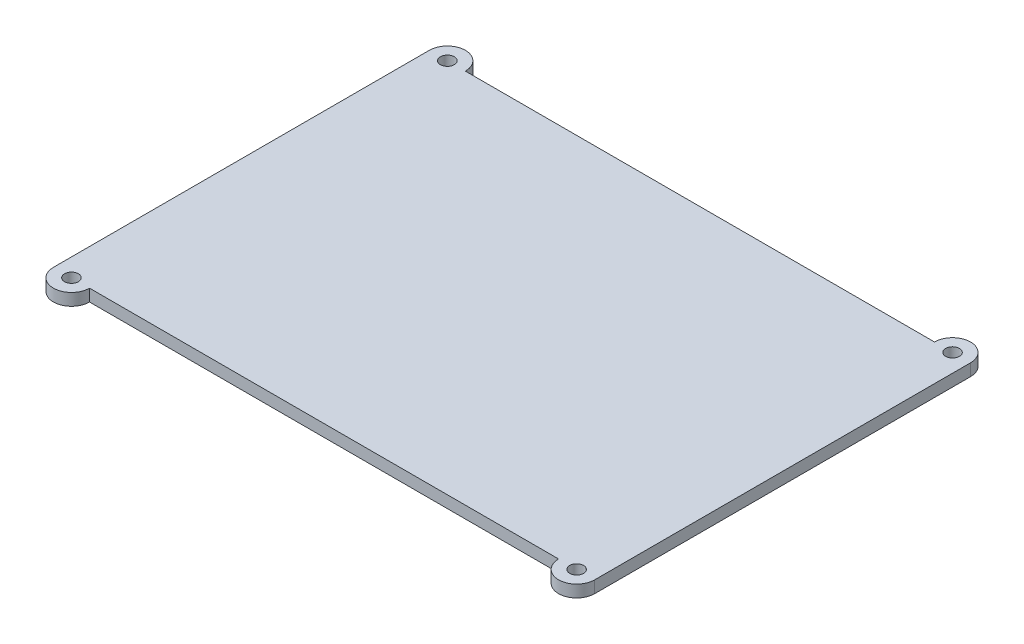
ISO-10303-21;
HEADER;
FILE_DESCRIPTION(('STEP AP214'),'2;1');
FILE_NAME('part.step','',(''),(''),'','','');
FILE_SCHEMA(('AUTOMOTIVE_DESIGN { 1 0 10303 214 1 1 1 1 }'));
ENDSEC;
DATA;
#1=APPLICATION_CONTEXT('core data for automotive mechanical design processes');
#2=APPLICATION_PROTOCOL_DEFINITION('international standard','automotive_design',2000,#1);
#3=PRODUCT_CONTEXT('',#1,'mechanical');
#4=PRODUCT('Part','Part','',(#3));
#5=PRODUCT_RELATED_PRODUCT_CATEGORY('part','',(#4));
#6=PRODUCT_DEFINITION_FORMATION('','',#4);
#7=PRODUCT_DEFINITION_CONTEXT('part definition',#1,'design');
#8=PRODUCT_DEFINITION('design','',#6,#7);
#9=PRODUCT_DEFINITION_SHAPE('','',#8);
#10=(LENGTH_UNIT() NAMED_UNIT(*) SI_UNIT(.MILLI.,.METRE.));
#11=(NAMED_UNIT(*) PLANE_ANGLE_UNIT() SI_UNIT($,.RADIAN.));
#12=(NAMED_UNIT(*) SI_UNIT($,.STERADIAN.) SOLID_ANGLE_UNIT());
#13=UNCERTAINTY_MEASURE_WITH_UNIT(LENGTH_MEASURE(1.E-05),#10,'distance_accuracy_value','');
#14=(GEOMETRIC_REPRESENTATION_CONTEXT(3) GLOBAL_UNCERTAINTY_ASSIGNED_CONTEXT((#13)) GLOBAL_UNIT_ASSIGNED_CONTEXT((#10,
#11,#12)) REPRESENTATION_CONTEXT('',''));
#15=CARTESIAN_POINT('',(0.,0.,0.));
#16=DIRECTION('',(0.,0.,1.));
#17=DIRECTION('',(1.,0.,0.));
#18=AXIS2_PLACEMENT_3D('',#15,#16,#17);
#19=CARTESIAN_POINT('',(3.,0.,0.));
#20=DIRECTION('',(0.,1.,0.));
#21=DIRECTION('',(0.,0.,1.));
#22=AXIS2_PLACEMENT_3D('',#19,#20,#21);
#23=PLANE('',#22);
#24=CARTESIAN_POINT('',(3.,0.,0.));
#25=DIRECTION('',(0.,1.,0.));
#26=DIRECTION('',(0.,0.,1.));
#27=AXIS2_PLACEMENT_3D('',#24,#25,#26);
#28=CIRCLE('',#27,3.);
#29=CARTESIAN_POINT('',(0.,0.,0.));
#30=VERTEX_POINT('',#29);
#31=CARTESIAN_POINT('',(6.,0.,0.));
#32=VERTEX_POINT('',#31);
#33=EDGE_CURVE('E174',#30,#32,#28,.T.);
#34=ORIENTED_EDGE('',*,*,#33,.F.);
#35=DIRECTION('',(0.,0.,1.));
#36=VECTOR('',#35,1.);
#37=CARTESIAN_POINT('',(0.,0.,0.));
#38=LINE('',#37,#36);
#39=CARTESIAN_POINT('',(0.,0.,-62.5));
#40=VERTEX_POINT('',#39);
#41=EDGE_CURVE('E181',#40,#30,#38,.T.);
#42=ORIENTED_EDGE('',*,*,#41,.F.);
#43=CARTESIAN_POINT('',(3.00000000000001,0.,-62.5));
#44=DIRECTION('',(0.,1.,0.));
#45=DIRECTION('',(0.,0.,-1.));
#46=AXIS2_PLACEMENT_3D('',#43,#44,#45);
#47=CIRCLE('',#46,3.00000000000002);
#48=CARTESIAN_POINT('',(6.00000000000002,0.,-62.5));
#49=VERTEX_POINT('',#48);
#50=EDGE_CURVE('E208',#49,#40,#47,.T.);
#51=ORIENTED_EDGE('',*,*,#50,.F.);
#52=DIRECTION('',(-1.,0.,0.));
#53=VECTOR('',#52,1.);
#54=CARTESIAN_POINT('',(6.00000000000001,0.,-62.5));
#55=LINE('',#54,#53);
#56=CARTESIAN_POINT('',(84.,0.,-62.5));
#57=VERTEX_POINT('',#56);
#58=EDGE_CURVE('E206',#57,#49,#55,.T.);
#59=ORIENTED_EDGE('',*,*,#58,.F.);
#60=CARTESIAN_POINT('',(87.,0.,-62.5));
#61=DIRECTION('',(0.,1.,0.));
#62=DIRECTION('',(0.,0.,1.));
#63=AXIS2_PLACEMENT_3D('',#60,#61,#62);
#64=CIRCLE('',#63,3.00000000000001);
#65=CARTESIAN_POINT('',(90.,0.,-62.5));
#66=VERTEX_POINT('',#65);
#67=EDGE_CURVE('E204',#66,#57,#64,.T.);
#68=ORIENTED_EDGE('',*,*,#67,.F.);
#69=DIRECTION('',(0.,0.,-1.));
#70=VECTOR('',#69,1.);
#71=CARTESIAN_POINT('',(90.,0.,0.));
#72=LINE('',#71,#70);
#73=CARTESIAN_POINT('',(90.,0.,0.));
#74=VERTEX_POINT('',#73);
#75=EDGE_CURVE('E202',#74,#66,#72,.T.);
#76=ORIENTED_EDGE('',*,*,#75,.F.);
#77=CARTESIAN_POINT('',(87.,0.,0.));
#78=DIRECTION('',(0.,1.,0.));
#79=DIRECTION('',(0.,0.,-1.));
#80=AXIS2_PLACEMENT_3D('',#77,#78,#79);
#81=CIRCLE('',#80,3.00000000000001);
#82=CARTESIAN_POINT('',(84.,0.,0.));
#83=VERTEX_POINT('',#82);
#84=EDGE_CURVE('E200',#83,#74,#81,.T.);
#85=ORIENTED_EDGE('',*,*,#84,.F.);
#86=DIRECTION('',(1.,0.,0.));
#87=VECTOR('',#86,1.);
#88=CARTESIAN_POINT('',(6.,0.,0.));
#89=LINE('',#88,#87);
#90=EDGE_CURVE('E198',#32,#83,#89,.T.);
#91=ORIENTED_EDGE('',*,*,#90,.F.);
#92=EDGE_LOOP('',(#34,#42,#51,#59,#68,#76,#85,#91));
#93=FACE_BOUND('',#92,.T.);
#94=CARTESIAN_POINT('',(3.00000000000001,0.,-62.5));
#95=DIRECTION('',(0.,1.,0.));
#96=DIRECTION('',(0.,0.,1.));
#97=AXIS2_PLACEMENT_3D('',#94,#95,#96);
#98=CIRCLE('',#97,1.15);
#99=CARTESIAN_POINT('',(3.00000000000001,0.,-61.35));
#100=VERTEX_POINT('',#99);
#101=EDGE_CURVE('E171',#100,#100,#98,.T.);
#102=ORIENTED_EDGE('',*,*,#101,.T.);
#103=EDGE_LOOP('',(#102));
#104=FACE_BOUND('',#103,.T.);
#105=CARTESIAN_POINT('',(87.,0.,-62.5));
#106=DIRECTION('',(0.,1.,0.));
#107=DIRECTION('',(0.,0.,-1.));
#108=AXIS2_PLACEMENT_3D('',#105,#106,#107);
#109=CIRCLE('',#108,1.15);
#110=CARTESIAN_POINT('',(87.,0.,-63.65));
#111=VERTEX_POINT('',#110);
#112=EDGE_CURVE('E156',#111,#111,#109,.T.);
#113=ORIENTED_EDGE('',*,*,#112,.T.);
#114=EDGE_LOOP('',(#113));
#115=FACE_BOUND('',#114,.T.);
#116=CARTESIAN_POINT('',(87.,0.,0.));
#117=DIRECTION('',(0.,1.,0.));
#118=DIRECTION('',(0.,0.,1.));
#119=AXIS2_PLACEMENT_3D('',#116,#117,#118);
#120=CIRCLE('',#119,1.15);
#121=CARTESIAN_POINT('',(87.,0.,1.15));
#122=VERTEX_POINT('',#121);
#123=EDGE_CURVE('E163',#122,#122,#120,.T.);
#124=ORIENTED_EDGE('',*,*,#123,.T.);
#125=EDGE_LOOP('',(#124));
#126=FACE_BOUND('',#125,.T.);
#127=CARTESIAN_POINT('',(3.,0.,0.));
#128=DIRECTION('',(0.,1.,0.));
#129=DIRECTION('',(0.,0.,-1.));
#130=AXIS2_PLACEMENT_3D('',#127,#128,#129);
#131=CIRCLE('',#130,1.15);
#132=CARTESIAN_POINT('',(3.,0.,-1.15));
#133=VERTEX_POINT('',#132);
#134=EDGE_CURVE('E150',#133,#133,#131,.T.);
#135=ORIENTED_EDGE('',*,*,#134,.T.);
#136=EDGE_LOOP('',(#135));
#137=FACE_BOUND('',#136,.T.);
#138=DIRECTION('',(0.,0.,-1.));
#139=VECTOR('',#138,1.);
#140=CARTESIAN_POINT('',(2.24999999999998,0.,-60.25));
#141=LINE('',#140,#139);
#142=CARTESIAN_POINT('',(2.24999999999997,0.,-2.25));
#143=VERTEX_POINT('',#142);
#144=CARTESIAN_POINT('',(2.24999999999998,0.,-60.25));
#145=VERTEX_POINT('',#144);
#146=EDGE_CURVE('E146',#143,#145,#141,.T.);
#147=ORIENTED_EDGE('',*,*,#146,.F.);
#148=DIRECTION('',(-1.,0.,0.));
#149=VECTOR('',#148,1.);
#150=CARTESIAN_POINT('',(2.24999999999997,0.,-2.25));
#151=LINE('',#150,#149);
#152=CARTESIAN_POINT('',(87.75,0.,-2.25));
#153=VERTEX_POINT('',#152);
#154=EDGE_CURVE('E143',#153,#143,#151,.T.);
#155=ORIENTED_EDGE('',*,*,#154,.F.);
#156=DIRECTION('',(0.,0.,1.));
#157=VECTOR('',#156,1.);
#158=CARTESIAN_POINT('',(87.75,0.,-60.25));
#159=LINE('',#158,#157);
#160=CARTESIAN_POINT('',(87.75,0.,-60.25));
#161=VERTEX_POINT('',#160);
#162=EDGE_CURVE('E57',#161,#153,#159,.T.);
#163=ORIENTED_EDGE('',*,*,#162,.F.);
#164=DIRECTION('',(1.,0.,0.));
#165=VECTOR('',#164,1.);
#166=CARTESIAN_POINT('',(2.24999999999998,0.,-60.25));
#167=LINE('',#166,#165);
#168=EDGE_CURVE('E52',#145,#161,#167,.T.);
#169=ORIENTED_EDGE('',*,*,#168,.F.);
#170=EDGE_LOOP('',(#147,#155,#163,#169));
#171=FACE_BOUND('',#170,.T.);
#172=ADVANCED_FACE('F37',(#93,#104,#115,#126,#137,#171),#23,.F.);
#173=CARTESIAN_POINT('',(3.,2.,0.));
#174=DIRECTION('',(0.,-1.,0.));
#175=DIRECTION('',(0.,0.,-1.));
#176=AXIS2_PLACEMENT_3D('',#173,#174,#175);
#177=CYLINDRICAL_SURFACE('',#176,3.);
#178=ORIENTED_EDGE('',*,*,#33,.T.);
#179=DIRECTION('',(0.,-1.,0.));
#180=VECTOR('',#179,1.);
#181=CARTESIAN_POINT('',(6.,2.,0.));
#182=LINE('',#181,#180);
#183=CARTESIAN_POINT('',(6.,2.,0.));
#184=VERTEX_POINT('',#183);
#185=EDGE_CURVE('E11',#184,#32,#182,.T.);
#186=ORIENTED_EDGE('',*,*,#185,.F.);
#187=CARTESIAN_POINT('',(3.,2.,0.));
#188=DIRECTION('',(0.,1.,0.));
#189=DIRECTION('',(0.,0.,1.));
#190=AXIS2_PLACEMENT_3D('',#187,#188,#189);
#191=CIRCLE('',#190,3.);
#192=CARTESIAN_POINT('',(0.,2.,0.));
#193=VERTEX_POINT('',#192);
#194=EDGE_CURVE('E177',#193,#184,#191,.T.);
#195=ORIENTED_EDGE('',*,*,#194,.F.);
#196=DIRECTION('',(0.,-1.,0.));
#197=VECTOR('',#196,1.);
#198=CARTESIAN_POINT('',(0.,2.,0.));
#199=LINE('',#198,#197);
#200=EDGE_CURVE('E195',#193,#30,#199,.T.);
#201=ORIENTED_EDGE('',*,*,#200,.T.);
#202=EDGE_LOOP('',(#178,#186,#195,#201));
#203=FACE_BOUND('',#202,.T.);
#204=ADVANCED_FACE('F39',(#203),#177,.T.);
#205=CARTESIAN_POINT('',(6.,2.,0.));
#206=DIRECTION('',(0.,0.,-1.));
#207=DIRECTION('',(-1.,0.,0.));
#208=AXIS2_PLACEMENT_3D('',#205,#206,#207);
#209=PLANE('',#208);
#210=ORIENTED_EDGE('',*,*,#90,.T.);
#211=DIRECTION('',(0.,-1.,0.));
#212=VECTOR('',#211,1.);
#213=CARTESIAN_POINT('',(84.,2.,0.));
#214=LINE('',#213,#212);
#215=CARTESIAN_POINT('',(84.,2.,0.));
#216=VERTEX_POINT('',#215);
#217=EDGE_CURVE('E45',#216,#83,#214,.T.);
#218=ORIENTED_EDGE('',*,*,#217,.F.);
#219=DIRECTION('',(1.,0.,0.));
#220=VECTOR('',#219,1.);
#221=CARTESIAN_POINT('',(6.,2.,0.));
#222=LINE('',#221,#220);
#223=EDGE_CURVE('E180',#184,#216,#222,.T.);
#224=ORIENTED_EDGE('',*,*,#223,.F.);
#225=ORIENTED_EDGE('',*,*,#185,.T.);
#226=EDGE_LOOP('',(#210,#218,#224,#225));
#227=FACE_BOUND('',#226,.T.);
#228=ADVANCED_FACE('F255',(#227),#209,.F.);
#229=CARTESIAN_POINT('',(87.,2.,0.));
#230=DIRECTION('',(0.,-1.,0.));
#231=DIRECTION('',(0.,0.,-1.));
#232=AXIS2_PLACEMENT_3D('',#229,#230,#231);
#233=CYLINDRICAL_SURFACE('',#232,3.00000000000001);
#234=ORIENTED_EDGE('',*,*,#84,.T.);
#235=DIRECTION('',(0.,-1.,0.));
#236=VECTOR('',#235,1.);
#237=CARTESIAN_POINT('',(90.,2.,0.));
#238=LINE('',#237,#236);
#239=CARTESIAN_POINT('',(90.,2.,0.));
#240=VERTEX_POINT('',#239);
#241=EDGE_CURVE('E225',#240,#74,#238,.T.);
#242=ORIENTED_EDGE('',*,*,#241,.F.);
#243=CARTESIAN_POINT('',(87.,2.,0.));
#244=DIRECTION('',(0.,1.,0.));
#245=DIRECTION('',(0.,0.,-1.));
#246=AXIS2_PLACEMENT_3D('',#243,#244,#245);
#247=CIRCLE('',#246,3.00000000000001);
#248=EDGE_CURVE('E183',#216,#240,#247,.T.);
#249=ORIENTED_EDGE('',*,*,#248,.F.);
#250=ORIENTED_EDGE('',*,*,#217,.T.);
#251=EDGE_LOOP('',(#234,#242,#249,#250));
#252=FACE_BOUND('',#251,.T.);
#253=ADVANCED_FACE('F232',(#252),#233,.T.);
#254=CARTESIAN_POINT('',(90.,2.,0.));
#255=DIRECTION('',(-1.,0.,0.));
#256=DIRECTION('',(0.,0.,1.));
#257=AXIS2_PLACEMENT_3D('',#254,#255,#256);
#258=PLANE('',#257);
#259=ORIENTED_EDGE('',*,*,#75,.T.);
#260=DIRECTION('',(0.,-1.,0.));
#261=VECTOR('',#260,1.);
#262=CARTESIAN_POINT('',(90.,2.,-62.5));
#263=LINE('',#262,#261);
#264=CARTESIAN_POINT('',(90.,2.,-62.5));
#265=VERTEX_POINT('',#264);
#266=EDGE_CURVE('E222',#265,#66,#263,.T.);
#267=ORIENTED_EDGE('',*,*,#266,.F.);
#268=DIRECTION('',(0.,0.,-1.));
#269=VECTOR('',#268,1.);
#270=CARTESIAN_POINT('',(90.,2.,0.));
#271=LINE('',#270,#269);
#272=EDGE_CURVE('E185',#240,#265,#271,.T.);
#273=ORIENTED_EDGE('',*,*,#272,.F.);
#274=ORIENTED_EDGE('',*,*,#241,.T.);
#275=EDGE_LOOP('',(#259,#267,#273,#274));
#276=FACE_BOUND('',#275,.T.);
#277=ADVANCED_FACE('F243',(#276),#258,.F.);
#278=CARTESIAN_POINT('',(87.,2.,-62.5));
#279=DIRECTION('',(0.,-1.,0.));
#280=DIRECTION('',(0.,0.,-1.));
#281=AXIS2_PLACEMENT_3D('',#278,#279,#280);
#282=CYLINDRICAL_SURFACE('',#281,3.00000000000001);
#283=ORIENTED_EDGE('',*,*,#67,.T.);
#284=DIRECTION('',(0.,-1.,0.));
#285=VECTOR('',#284,1.);
#286=CARTESIAN_POINT('',(84.,2.,-62.5));
#287=LINE('',#286,#285);
#288=CARTESIAN_POINT('',(84.,2.,-62.5));
#289=VERTEX_POINT('',#288);
#290=EDGE_CURVE('E219',#289,#57,#287,.T.);
#291=ORIENTED_EDGE('',*,*,#290,.F.);
#292=CARTESIAN_POINT('',(87.,2.,-62.5));
#293=DIRECTION('',(0.,1.,0.));
#294=DIRECTION('',(0.,0.,1.));
#295=AXIS2_PLACEMENT_3D('',#292,#293,#294);
#296=CIRCLE('',#295,3.00000000000001);
#297=EDGE_CURVE('E187',#265,#289,#296,.T.);
#298=ORIENTED_EDGE('',*,*,#297,.F.);
#299=ORIENTED_EDGE('',*,*,#266,.T.);
#300=EDGE_LOOP('',(#283,#291,#298,#299));
#301=FACE_BOUND('',#300,.T.);
#302=ADVANCED_FACE('F247',(#301),#282,.T.);
#303=CARTESIAN_POINT('',(6.00000000000001,2.,-62.5));
#304=DIRECTION('',(0.,0.,1.));
#305=DIRECTION('',(1.,0.,0.));
#306=AXIS2_PLACEMENT_3D('',#303,#304,#305);
#307=PLANE('',#306);
#308=ORIENTED_EDGE('',*,*,#58,.T.);
#309=DIRECTION('',(0.,-1.,0.));
#310=VECTOR('',#309,1.);
#311=CARTESIAN_POINT('',(6.00000000000002,2.,-62.5));
#312=LINE('',#311,#310);
#313=CARTESIAN_POINT('',(6.00000000000002,2.,-62.5));
#314=VERTEX_POINT('',#313);
#315=EDGE_CURVE('E216',#314,#49,#312,.T.);
#316=ORIENTED_EDGE('',*,*,#315,.F.);
#317=DIRECTION('',(-1.,0.,0.));
#318=VECTOR('',#317,1.);
#319=CARTESIAN_POINT('',(6.00000000000001,2.,-62.5));
#320=LINE('',#319,#318);
#321=EDGE_CURVE('E189',#289,#314,#320,.T.);
#322=ORIENTED_EDGE('',*,*,#321,.F.);
#323=ORIENTED_EDGE('',*,*,#290,.T.);
#324=EDGE_LOOP('',(#308,#316,#322,#323));
#325=FACE_BOUND('',#324,.T.);
#326=ADVANCED_FACE('F268',(#325),#307,.F.);
#327=CARTESIAN_POINT('',(3.00000000000001,2.,-62.5));
#328=DIRECTION('',(0.,-1.,0.));
#329=DIRECTION('',(0.,0.,-1.));
#330=AXIS2_PLACEMENT_3D('',#327,#328,#329);
#331=CYLINDRICAL_SURFACE('',#330,3.00000000000002);
#332=ORIENTED_EDGE('',*,*,#50,.T.);
#333=DIRECTION('',(0.,-1.,0.));
#334=VECTOR('',#333,1.);
#335=CARTESIAN_POINT('',(0.,2.,-62.5));
#336=LINE('',#335,#334);
#337=CARTESIAN_POINT('',(0.,2.,-62.5));
#338=VERTEX_POINT('',#337);
#339=EDGE_CURVE('E213',#338,#40,#336,.T.);
#340=ORIENTED_EDGE('',*,*,#339,.F.);
#341=CARTESIAN_POINT('',(3.00000000000001,2.,-62.5));
#342=DIRECTION('',(0.,1.,0.));
#343=DIRECTION('',(0.,0.,-1.));
#344=AXIS2_PLACEMENT_3D('',#341,#342,#343);
#345=CIRCLE('',#344,3.00000000000002);
#346=EDGE_CURVE('E191',#314,#338,#345,.T.);
#347=ORIENTED_EDGE('',*,*,#346,.F.);
#348=ORIENTED_EDGE('',*,*,#315,.T.);
#349=EDGE_LOOP('',(#332,#340,#347,#348));
#350=FACE_BOUND('',#349,.T.);
#351=ADVANCED_FACE('F266',(#350),#331,.T.);
#352=CARTESIAN_POINT('',(0.,2.,0.));
#353=DIRECTION('',(1.,0.,0.));
#354=DIRECTION('',(0.,0.,-1.));
#355=AXIS2_PLACEMENT_3D('',#352,#353,#354);
#356=PLANE('',#355);
#357=ORIENTED_EDGE('',*,*,#41,.T.);
#358=ORIENTED_EDGE('',*,*,#200,.F.);
#359=DIRECTION('',(0.,0.,1.));
#360=VECTOR('',#359,1.);
#361=CARTESIAN_POINT('',(0.,2.,0.));
#362=LINE('',#361,#360);
#363=EDGE_CURVE('E193',#338,#193,#362,.T.);
#364=ORIENTED_EDGE('',*,*,#363,.F.);
#365=ORIENTED_EDGE('',*,*,#339,.T.);
#366=EDGE_LOOP('',(#357,#358,#364,#365));
#367=FACE_BOUND('',#366,.T.);
#368=ADVANCED_FACE('F261',(#367),#356,.F.);
#369=CARTESIAN_POINT('',(3.,2.,0.));
#370=DIRECTION('',(0.,1.,0.));
#371=DIRECTION('',(0.,0.,1.));
#372=AXIS2_PLACEMENT_3D('',#369,#370,#371);
#373=PLANE('',#372);
#374=CARTESIAN_POINT('',(3.,2.,0.));
#375=DIRECTION('',(0.,1.,0.));
#376=DIRECTION('',(0.,0.,-1.));
#377=AXIS2_PLACEMENT_3D('',#374,#375,#376);
#378=CIRCLE('',#377,1.15);
#379=CARTESIAN_POINT('',(3.,2.,-1.15));
#380=VERTEX_POINT('',#379);
#381=EDGE_CURVE('E147',#380,#380,#378,.T.);
#382=ORIENTED_EDGE('',*,*,#381,.F.);
#383=EDGE_LOOP('',(#382));
#384=FACE_BOUND('',#383,.T.);
#385=CARTESIAN_POINT('',(87.,2.,0.));
#386=DIRECTION('',(0.,1.,0.));
#387=DIRECTION('',(0.,0.,1.));
#388=AXIS2_PLACEMENT_3D('',#385,#386,#387);
#389=CIRCLE('',#388,1.15);
#390=CARTESIAN_POINT('',(87.,2.,1.15));
#391=VERTEX_POINT('',#390);
#392=EDGE_CURVE('E166',#391,#391,#389,.T.);
#393=ORIENTED_EDGE('',*,*,#392,.F.);
#394=EDGE_LOOP('',(#393));
#395=FACE_BOUND('',#394,.T.);
#396=CARTESIAN_POINT('',(87.,2.,-62.5));
#397=DIRECTION('',(0.,1.,0.));
#398=DIRECTION('',(0.,0.,-1.));
#399=AXIS2_PLACEMENT_3D('',#396,#397,#398);
#400=CIRCLE('',#399,1.15);
#401=CARTESIAN_POINT('',(87.,2.,-63.65));
#402=VERTEX_POINT('',#401);
#403=EDGE_CURVE('E160',#402,#402,#400,.T.);
#404=ORIENTED_EDGE('',*,*,#403,.F.);
#405=EDGE_LOOP('',(#404));
#406=FACE_BOUND('',#405,.T.);
#407=CARTESIAN_POINT('',(3.00000000000001,2.,-62.5));
#408=DIRECTION('',(0.,1.,0.));
#409=DIRECTION('',(0.,0.,1.));
#410=AXIS2_PLACEMENT_3D('',#407,#408,#409);
#411=CIRCLE('',#410,1.15);
#412=CARTESIAN_POINT('',(3.00000000000001,2.,-61.35));
#413=VERTEX_POINT('',#412);
#414=EDGE_CURVE('E159',#413,#413,#411,.T.);
#415=ORIENTED_EDGE('',*,*,#414,.F.);
#416=EDGE_LOOP('',(#415));
#417=FACE_BOUND('',#416,.T.);
#418=ORIENTED_EDGE('',*,*,#194,.T.);
#419=ORIENTED_EDGE('',*,*,#223,.T.);
#420=ORIENTED_EDGE('',*,*,#248,.T.);
#421=ORIENTED_EDGE('',*,*,#272,.T.);
#422=ORIENTED_EDGE('',*,*,#297,.T.);
#423=ORIENTED_EDGE('',*,*,#321,.T.);
#424=ORIENTED_EDGE('',*,*,#346,.T.);
#425=ORIENTED_EDGE('',*,*,#363,.T.);
#426=EDGE_LOOP('',(#418,#419,#420,#421,#422,#423,#424,#425));
#427=FACE_BOUND('',#426,.T.);
#428=ADVANCED_FACE('F251',(#384,#395,#406,#417,#427),#373,.T.);
#429=CARTESIAN_POINT('',(3.00000000000001,0.,-62.5));
#430=DIRECTION('',(0.,1.,0.));
#431=DIRECTION('',(0.,0.,1.));
#432=AXIS2_PLACEMENT_3D('',#429,#430,#431);
#433=CYLINDRICAL_SURFACE('',#432,1.15);
#434=ORIENTED_EDGE('',*,*,#101,.F.);
#435=EDGE_LOOP('',(#434));
#436=FACE_BOUND('',#435,.T.);
#437=ORIENTED_EDGE('',*,*,#414,.T.);
#438=EDGE_LOOP('',(#437));
#439=FACE_BOUND('',#438,.T.);
#440=ADVANCED_FACE('F289',(#436,#439),#433,.F.);
#441=CARTESIAN_POINT('',(87.,0.,-62.5));
#442=DIRECTION('',(0.,1.,0.));
#443=DIRECTION('',(0.,0.,1.));
#444=AXIS2_PLACEMENT_3D('',#441,#442,#443);
#445=CYLINDRICAL_SURFACE('',#444,1.15);
#446=ORIENTED_EDGE('',*,*,#112,.F.);
#447=EDGE_LOOP('',(#446));
#448=FACE_BOUND('',#447,.T.);
#449=ORIENTED_EDGE('',*,*,#403,.T.);
#450=EDGE_LOOP('',(#449));
#451=FACE_BOUND('',#450,.T.);
#452=ADVANCED_FACE('F294',(#448,#451),#445,.F.);
#453=CARTESIAN_POINT('',(87.,0.,0.));
#454=DIRECTION('',(0.,1.,0.));
#455=DIRECTION('',(0.,0.,1.));
#456=AXIS2_PLACEMENT_3D('',#453,#454,#455);
#457=CYLINDRICAL_SURFACE('',#456,1.15);
#458=ORIENTED_EDGE('',*,*,#123,.F.);
#459=EDGE_LOOP('',(#458));
#460=FACE_BOUND('',#459,.T.);
#461=ORIENTED_EDGE('',*,*,#392,.T.);
#462=EDGE_LOOP('',(#461));
#463=FACE_BOUND('',#462,.T.);
#464=ADVANCED_FACE('F306',(#460,#463),#457,.F.);
#465=CARTESIAN_POINT('',(3.,0.,0.));
#466=DIRECTION('',(0.,1.,0.));
#467=DIRECTION('',(0.,0.,1.));
#468=AXIS2_PLACEMENT_3D('',#465,#466,#467);
#469=CYLINDRICAL_SURFACE('',#468,1.15);
#470=ORIENTED_EDGE('',*,*,#134,.F.);
#471=EDGE_LOOP('',(#470));
#472=FACE_BOUND('',#471,.T.);
#473=ORIENTED_EDGE('',*,*,#381,.T.);
#474=EDGE_LOOP('',(#473));
#475=FACE_BOUND('',#474,.T.);
#476=ADVANCED_FACE('F312',(#472,#475),#469,.F.);
#477=CARTESIAN_POINT('',(2.24999999999998,-2.,-60.25));
#478=DIRECTION('',(1.,0.,0.));
#479=DIRECTION('',(0.,0.,-1.));
#480=AXIS2_PLACEMENT_3D('',#477,#478,#479);
#481=PLANE('',#480);
#482=ORIENTED_EDGE('',*,*,#146,.T.);
#483=DIRECTION('',(0.,1.,0.));
#484=VECTOR('',#483,1.);
#485=CARTESIAN_POINT('',(2.24999999999998,-2.,-60.25));
#486=LINE('',#485,#484);
#487=CARTESIAN_POINT('',(2.24999999999998,-2.,-60.25));
#488=VERTEX_POINT('',#487);
#489=EDGE_CURVE('E127',#488,#145,#486,.T.);
#490=ORIENTED_EDGE('',*,*,#489,.F.);
#491=DIRECTION('',(0.,0.,-1.));
#492=VECTOR('',#491,1.);
#493=CARTESIAN_POINT('',(2.24999999999998,-2.,-60.25));
#494=LINE('',#493,#492);
#495=CARTESIAN_POINT('',(2.24999999999997,-2.,-2.25));
#496=VERTEX_POINT('',#495);
#497=EDGE_CURVE('E134',#496,#488,#494,.T.);
#498=ORIENTED_EDGE('',*,*,#497,.F.);
#499=DIRECTION('',(0.,1.,0.));
#500=VECTOR('',#499,1.);
#501=CARTESIAN_POINT('',(2.24999999999997,-2.,-2.25));
#502=LINE('',#501,#500);
#503=EDGE_CURVE('E332',#496,#143,#502,.T.);
#504=ORIENTED_EDGE('',*,*,#503,.T.);
#505=EDGE_LOOP('',(#482,#490,#498,#504));
#506=FACE_BOUND('',#505,.T.);
#507=ADVANCED_FACE('F145',(#506),#481,.F.);
#508=CARTESIAN_POINT('',(2.24999999999998,-2.,-60.25));
#509=DIRECTION('',(0.,0.,1.));
#510=DIRECTION('',(1.,0.,0.));
#511=AXIS2_PLACEMENT_3D('',#508,#509,#510);
#512=PLANE('',#511);
#513=ORIENTED_EDGE('',*,*,#168,.T.);
#514=DIRECTION('',(0.,1.,0.));
#515=VECTOR('',#514,1.);
#516=CARTESIAN_POINT('',(87.75,-2.,-60.25));
#517=LINE('',#516,#515);
#518=CARTESIAN_POINT('',(87.75,-2.,-60.25));
#519=VERTEX_POINT('',#518);
#520=EDGE_CURVE('E130',#519,#161,#517,.T.);
#521=ORIENTED_EDGE('',*,*,#520,.F.);
#522=DIRECTION('',(1.,0.,0.));
#523=VECTOR('',#522,1.);
#524=CARTESIAN_POINT('',(2.24999999999998,-2.,-60.25));
#525=LINE('',#524,#523);
#526=EDGE_CURVE('E123',#488,#519,#525,.T.);
#527=ORIENTED_EDGE('',*,*,#526,.F.);
#528=ORIENTED_EDGE('',*,*,#489,.T.);
#529=EDGE_LOOP('',(#513,#521,#527,#528));
#530=FACE_BOUND('',#529,.T.);
#531=ADVANCED_FACE('F125',(#530),#512,.F.);
#532=CARTESIAN_POINT('',(87.75,-2.,-60.25));
#533=DIRECTION('',(-1.,0.,0.));
#534=DIRECTION('',(0.,0.,1.));
#535=AXIS2_PLACEMENT_3D('',#532,#533,#534);
#536=PLANE('',#535);
#537=ORIENTED_EDGE('',*,*,#162,.T.);
#538=DIRECTION('',(0.,1.,0.));
#539=VECTOR('',#538,1.);
#540=CARTESIAN_POINT('',(87.75,-2.,-2.25));
#541=LINE('',#540,#539);
#542=CARTESIAN_POINT('',(87.75,-2.,-2.25));
#543=VERTEX_POINT('',#542);
#544=EDGE_CURVE('E152',#543,#153,#541,.T.);
#545=ORIENTED_EDGE('',*,*,#544,.F.);
#546=DIRECTION('',(0.,0.,1.));
#547=VECTOR('',#546,1.);
#548=CARTESIAN_POINT('',(87.75,-2.,-60.25));
#549=LINE('',#548,#547);
#550=EDGE_CURVE('E133',#519,#543,#549,.T.);
#551=ORIENTED_EDGE('',*,*,#550,.F.);
#552=ORIENTED_EDGE('',*,*,#520,.T.);
#553=EDGE_LOOP('',(#537,#545,#551,#552));
#554=FACE_BOUND('',#553,.T.);
#555=ADVANCED_FACE('F341',(#554),#536,.F.);
#556=CARTESIAN_POINT('',(2.24999999999997,-2.,-2.25));
#557=DIRECTION('',(0.,0.,-1.));
#558=DIRECTION('',(-1.,0.,0.));
#559=AXIS2_PLACEMENT_3D('',#556,#557,#558);
#560=PLANE('',#559);
#561=ORIENTED_EDGE('',*,*,#154,.T.);
#562=ORIENTED_EDGE('',*,*,#503,.F.);
#563=DIRECTION('',(-1.,0.,0.));
#564=VECTOR('',#563,1.);
#565=CARTESIAN_POINT('',(2.24999999999997,-2.,-2.25));
#566=LINE('',#565,#564);
#567=EDGE_CURVE('E139',#543,#496,#566,.T.);
#568=ORIENTED_EDGE('',*,*,#567,.F.);
#569=ORIENTED_EDGE('',*,*,#544,.T.);
#570=EDGE_LOOP('',(#561,#562,#568,#569));
#571=FACE_BOUND('',#570,.T.);
#572=ADVANCED_FACE('F331',(#571),#560,.F.);
#573=CARTESIAN_POINT('',(0.,-2.,0.));
#574=DIRECTION('',(0.,1.,0.));
#575=DIRECTION('',(0.,0.,1.));
#576=AXIS2_PLACEMENT_3D('',#573,#574,#575);
#577=PLANE('',#576);
#578=ORIENTED_EDGE('',*,*,#497,.T.);
#579=ORIENTED_EDGE('',*,*,#526,.T.);
#580=ORIENTED_EDGE('',*,*,#550,.T.);
#581=ORIENTED_EDGE('',*,*,#567,.T.);
#582=EDGE_LOOP('',(#578,#579,#580,#581));
#583=FACE_BOUND('',#582,.T.);
#584=ADVANCED_FACE('F137',(#583),#577,.F.);
#585=CLOSED_SHELL('',(#172,#204,#228,#253,#277,#302,#326,#351,#368,#428,#440,#452,#464,#476,
#507,#531,#555,#572,#584));
#586=MANIFOLD_SOLID_BREP('B2',#585);
#587=ADVANCED_BREP_SHAPE_REPRESENTATION('',(#18,#586),#14);
#588=SHAPE_DEFINITION_REPRESENTATION(#9,#587);
ENDSEC;
END-ISO-10303-21;
